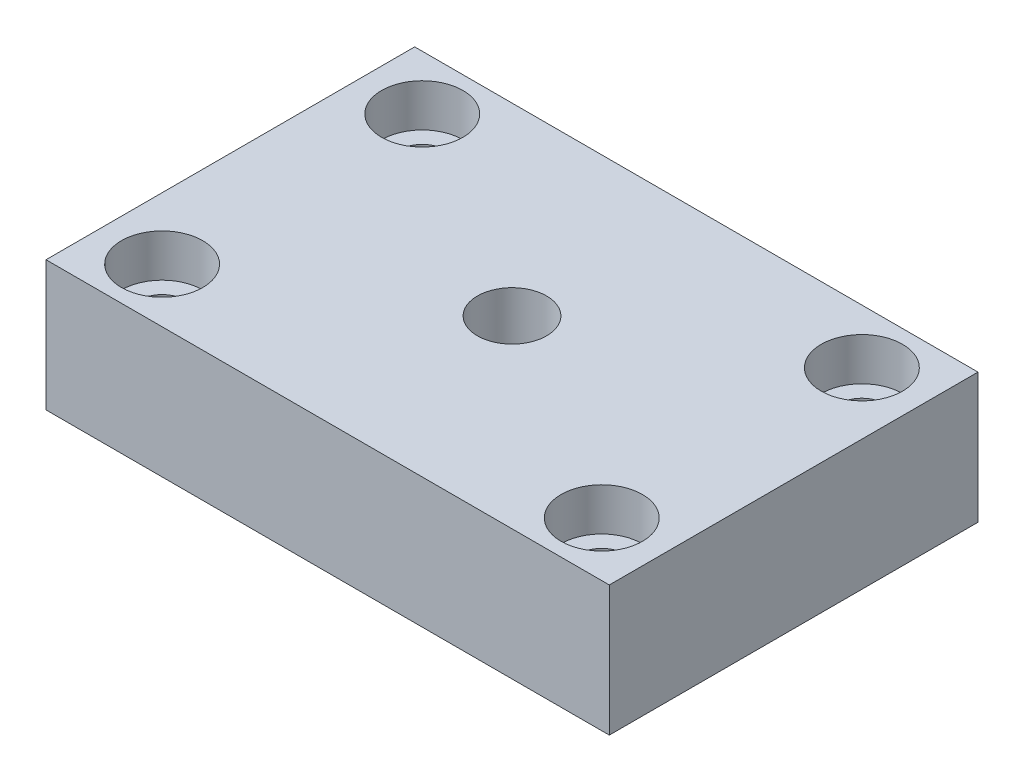
ISO-10303-21;
HEADER;
FILE_DESCRIPTION(('STEP AP214'),'2;1');
FILE_NAME('part.step','',(''),(''),'','','');
FILE_SCHEMA(('AUTOMOTIVE_DESIGN { 1 0 10303 214 1 1 1 1 }'));
ENDSEC;
DATA;
#1=APPLICATION_CONTEXT('core data for automotive mechanical design processes');
#2=APPLICATION_PROTOCOL_DEFINITION('international standard','automotive_design',2000,#1);
#3=PRODUCT_CONTEXT('',#1,'mechanical');
#4=PRODUCT('Part','Part','',(#3));
#5=PRODUCT_RELATED_PRODUCT_CATEGORY('part','',(#4));
#6=PRODUCT_DEFINITION_FORMATION('','',#4);
#7=PRODUCT_DEFINITION_CONTEXT('part definition',#1,'design');
#8=PRODUCT_DEFINITION('design','',#6,#7);
#9=PRODUCT_DEFINITION_SHAPE('','',#8);
#10=(LENGTH_UNIT() NAMED_UNIT(*) SI_UNIT(.MILLI.,.METRE.));
#11=(NAMED_UNIT(*) PLANE_ANGLE_UNIT() SI_UNIT($,.RADIAN.));
#12=(NAMED_UNIT(*) SI_UNIT($,.STERADIAN.) SOLID_ANGLE_UNIT());
#13=UNCERTAINTY_MEASURE_WITH_UNIT(LENGTH_MEASURE(1.E-05),#10,'distance_accuracy_value','');
#14=(GEOMETRIC_REPRESENTATION_CONTEXT(3) GLOBAL_UNCERTAINTY_ASSIGNED_CONTEXT((#13)) GLOBAL_UNIT_ASSIGNED_CONTEXT((#10,
#11,#12)) REPRESENTATION_CONTEXT('',''));
#15=CARTESIAN_POINT('',(0.,0.,0.));
#16=DIRECTION('',(0.,0.,1.));
#17=DIRECTION('',(1.,0.,0.));
#18=AXIS2_PLACEMENT_3D('',#15,#16,#17);
#19=CARTESIAN_POINT('',(27.5,12.7,18.));
#20=DIRECTION('',(-1.,0.,0.));
#21=DIRECTION('',(0.,0.,1.));
#22=AXIS2_PLACEMENT_3D('',#19,#20,#21);
#23=PLANE('',#22);
#24=DIRECTION('',(0.,0.,-1.));
#25=VECTOR('',#24,1.);
#26=CARTESIAN_POINT('',(27.5,0.,18.));
#27=LINE('',#26,#25);
#28=CARTESIAN_POINT('',(27.5,0.,18.));
#29=VERTEX_POINT('',#28);
#30=CARTESIAN_POINT('',(27.5,0.,-18.));
#31=VERTEX_POINT('',#30);
#32=EDGE_CURVE('E99',#29,#31,#27,.T.);
#33=ORIENTED_EDGE('',*,*,#32,.T.);
#34=DIRECTION('',(0.,-1.,0.));
#35=VECTOR('',#34,1.);
#36=CARTESIAN_POINT('',(27.5,12.7,-18.));
#37=LINE('',#36,#35);
#38=CARTESIAN_POINT('',(27.5,12.7,-18.));
#39=VERTEX_POINT('',#38);
#40=EDGE_CURVE('E11',#39,#31,#37,.T.);
#41=ORIENTED_EDGE('',*,*,#40,.F.);
#42=DIRECTION('',(0.,0.,-1.));
#43=VECTOR('',#42,1.);
#44=CARTESIAN_POINT('',(27.5,12.7,18.));
#45=LINE('',#44,#43);
#46=CARTESIAN_POINT('',(27.5,12.7,18.));
#47=VERTEX_POINT('',#46);
#48=EDGE_CURVE('E87',#47,#39,#45,.T.);
#49=ORIENTED_EDGE('',*,*,#48,.F.);
#50=DIRECTION('',(0.,-1.,0.));
#51=VECTOR('',#50,1.);
#52=CARTESIAN_POINT('',(27.5,12.7,18.));
#53=LINE('',#52,#51);
#54=EDGE_CURVE('E95',#47,#29,#53,.T.);
#55=ORIENTED_EDGE('',*,*,#54,.T.);
#56=EDGE_LOOP('',(#33,#41,#49,#55));
#57=FACE_BOUND('',#56,.T.);
#58=ADVANCED_FACE('F36',(#57),#23,.F.);
#59=CARTESIAN_POINT('',(-27.5,12.7,-18.));
#60=DIRECTION('',(0.,0.,1.));
#61=DIRECTION('',(1.,0.,0.));
#62=AXIS2_PLACEMENT_3D('',#59,#60,#61);
#63=PLANE('',#62);
#64=DIRECTION('',(-1.,0.,0.));
#65=VECTOR('',#64,1.);
#66=CARTESIAN_POINT('',(-27.5,0.,-18.));
#67=LINE('',#66,#65);
#68=CARTESIAN_POINT('',(-27.5,0.,-18.));
#69=VERTEX_POINT('',#68);
#70=EDGE_CURVE('E91',#31,#69,#67,.T.);
#71=ORIENTED_EDGE('',*,*,#70,.T.);
#72=DIRECTION('',(0.,-1.,0.));
#73=VECTOR('',#72,1.);
#74=CARTESIAN_POINT('',(-27.5,12.7,-18.));
#75=LINE('',#74,#73);
#76=CARTESIAN_POINT('',(-27.5,12.7,-18.));
#77=VERTEX_POINT('',#76);
#78=EDGE_CURVE('E44',#77,#69,#75,.T.);
#79=ORIENTED_EDGE('',*,*,#78,.F.);
#80=DIRECTION('',(-1.,0.,0.));
#81=VECTOR('',#80,1.);
#82=CARTESIAN_POINT('',(-27.5,12.7,-18.));
#83=LINE('',#82,#81);
#84=EDGE_CURVE('E82',#39,#77,#83,.T.);
#85=ORIENTED_EDGE('',*,*,#84,.F.);
#86=ORIENTED_EDGE('',*,*,#40,.T.);
#87=EDGE_LOOP('',(#71,#79,#85,#86));
#88=FACE_BOUND('',#87,.T.);
#89=ADVANCED_FACE('F90',(#88),#63,.F.);
#90=CARTESIAN_POINT('',(-27.5,12.7,18.));
#91=DIRECTION('',(1.,0.,0.));
#92=DIRECTION('',(0.,0.,-1.));
#93=AXIS2_PLACEMENT_3D('',#90,#91,#92);
#94=PLANE('',#93);
#95=DIRECTION('',(0.,0.,1.));
#96=VECTOR('',#95,1.);
#97=CARTESIAN_POINT('',(-27.5,0.,18.));
#98=LINE('',#97,#96);
#99=CARTESIAN_POINT('',(-27.5,0.,18.));
#100=VERTEX_POINT('',#99);
#101=EDGE_CURVE('E69',#69,#100,#98,.T.);
#102=ORIENTED_EDGE('',*,*,#101,.T.);
#103=DIRECTION('',(0.,-1.,0.));
#104=VECTOR('',#103,1.);
#105=CARTESIAN_POINT('',(-27.5,12.7,18.));
#106=LINE('',#105,#104);
#107=CARTESIAN_POINT('',(-27.5,12.7,18.));
#108=VERTEX_POINT('',#107);
#109=EDGE_CURVE('E92',#108,#100,#106,.T.);
#110=ORIENTED_EDGE('',*,*,#109,.F.);
#111=DIRECTION('',(0.,0.,1.));
#112=VECTOR('',#111,1.);
#113=CARTESIAN_POINT('',(-27.5,12.7,18.));
#114=LINE('',#113,#112);
#115=EDGE_CURVE('E85',#77,#108,#114,.T.);
#116=ORIENTED_EDGE('',*,*,#115,.F.);
#117=ORIENTED_EDGE('',*,*,#78,.T.);
#118=EDGE_LOOP('',(#102,#110,#116,#117));
#119=FACE_BOUND('',#118,.T.);
#120=ADVANCED_FACE('F93',(#119),#94,.F.);
#121=CARTESIAN_POINT('',(-27.5,12.7,18.));
#122=DIRECTION('',(0.,0.,-1.));
#123=DIRECTION('',(-1.,0.,0.));
#124=AXIS2_PLACEMENT_3D('',#121,#122,#123);
#125=PLANE('',#124);
#126=DIRECTION('',(1.,0.,0.));
#127=VECTOR('',#126,1.);
#128=CARTESIAN_POINT('',(-27.5,0.,18.));
#129=LINE('',#128,#127);
#130=EDGE_CURVE('E75',#100,#29,#129,.T.);
#131=ORIENTED_EDGE('',*,*,#130,.T.);
#132=ORIENTED_EDGE('',*,*,#54,.F.);
#133=DIRECTION('',(1.,0.,0.));
#134=VECTOR('',#133,1.);
#135=CARTESIAN_POINT('',(-27.5,12.7,18.));
#136=LINE('',#135,#134);
#137=EDGE_CURVE('E52',#108,#47,#136,.T.);
#138=ORIENTED_EDGE('',*,*,#137,.F.);
#139=ORIENTED_EDGE('',*,*,#109,.T.);
#140=EDGE_LOOP('',(#131,#132,#138,#139));
#141=FACE_BOUND('',#140,.T.);
#142=ADVANCED_FACE('F107',(#141),#125,.F.);
#143=CARTESIAN_POINT('',(0.,12.7,0.));
#144=DIRECTION('',(0.,-1.,0.));
#145=DIRECTION('',(0.,0.,-1.));
#146=AXIS2_PLACEMENT_3D('',#143,#144,#145);
#147=PLANE('',#146);
#148=CARTESIAN_POINT('',(0.,12.7,0.));
#149=DIRECTION('',(0.,-1.,0.));
#150=DIRECTION('',(0.,0.,-1.));
#151=AXIS2_PLACEMENT_3D('',#148,#149,#150);
#152=CIRCLE('',#151,3.3782);
#153=CARTESIAN_POINT('',(0.,12.7,-3.3782));
#154=VERTEX_POINT('',#153);
#155=EDGE_CURVE('E160',#154,#154,#152,.T.);
#156=ORIENTED_EDGE('',*,*,#155,.T.);
#157=EDGE_LOOP('',(#156));
#158=FACE_BOUND('',#157,.T.);
#159=CARTESIAN_POINT('',(-21.463,12.7,-12.7));
#160=DIRECTION('',(0.,1.,0.));
#161=DIRECTION('',(0.,0.,1.));
#162=AXIS2_PLACEMENT_3D('',#159,#160,#161);
#163=CIRCLE('',#162,3.96875);
#164=CARTESIAN_POINT('',(-21.463,12.7,-8.73125));
#165=VERTEX_POINT('',#164);
#166=EDGE_CURVE('E157',#165,#165,#163,.T.);
#167=ORIENTED_EDGE('',*,*,#166,.F.);
#168=EDGE_LOOP('',(#167));
#169=FACE_BOUND('',#168,.T.);
#170=CARTESIAN_POINT('',(-21.463,12.7,12.7));
#171=DIRECTION('',(0.,1.,0.));
#172=DIRECTION('',(0.,0.,1.));
#173=AXIS2_PLACEMENT_3D('',#170,#171,#172);
#174=CIRCLE('',#173,3.96875);
#175=CARTESIAN_POINT('',(-21.463,12.7,16.66875));
#176=VERTEX_POINT('',#175);
#177=EDGE_CURVE('E145',#176,#176,#174,.T.);
#178=ORIENTED_EDGE('',*,*,#177,.F.);
#179=EDGE_LOOP('',(#178));
#180=FACE_BOUND('',#179,.T.);
#181=CARTESIAN_POINT('',(21.463,12.7,12.7));
#182=DIRECTION('',(0.,1.,0.));
#183=DIRECTION('',(0.,0.,1.));
#184=AXIS2_PLACEMENT_3D('',#181,#182,#183);
#185=CIRCLE('',#184,3.96875);
#186=CARTESIAN_POINT('',(21.463,12.7,16.66875));
#187=VERTEX_POINT('',#186);
#188=EDGE_CURVE('E133',#187,#187,#185,.T.);
#189=ORIENTED_EDGE('',*,*,#188,.F.);
#190=EDGE_LOOP('',(#189));
#191=FACE_BOUND('',#190,.T.);
#192=CARTESIAN_POINT('',(21.463,12.7,-12.7));
#193=DIRECTION('',(0.,1.,0.));
#194=DIRECTION('',(0.,0.,1.));
#195=AXIS2_PLACEMENT_3D('',#192,#193,#194);
#196=CIRCLE('',#195,3.96875);
#197=CARTESIAN_POINT('',(21.463,12.7,-8.73125));
#198=VERTEX_POINT('',#197);
#199=EDGE_CURVE('E121',#198,#198,#196,.T.);
#200=ORIENTED_EDGE('',*,*,#199,.F.);
#201=EDGE_LOOP('',(#200));
#202=FACE_BOUND('',#201,.T.);
#203=ORIENTED_EDGE('',*,*,#48,.T.);
#204=ORIENTED_EDGE('',*,*,#84,.T.);
#205=ORIENTED_EDGE('',*,*,#115,.T.);
#206=ORIENTED_EDGE('',*,*,#137,.T.);
#207=EDGE_LOOP('',(#203,#204,#205,#206));
#208=FACE_BOUND('',#207,.T.);
#209=ADVANCED_FACE('F83',(#158,#169,#180,#191,#202,#208),#147,.F.);
#210=CARTESIAN_POINT('',(0.,0.,0.));
#211=DIRECTION('',(0.,-1.,0.));
#212=DIRECTION('',(0.,0.,-1.));
#213=AXIS2_PLACEMENT_3D('',#210,#211,#212);
#214=PLANE('',#213);
#215=CARTESIAN_POINT('',(0.,0.,0.));
#216=DIRECTION('',(0.,-1.,0.));
#217=DIRECTION('',(0.,0.,-1.));
#218=AXIS2_PLACEMENT_3D('',#215,#216,#217);
#219=CIRCLE('',#218,5.55625);
#220=CARTESIAN_POINT('',(0.,0.,-5.55625));
#221=VERTEX_POINT('',#220);
#222=EDGE_CURVE('E169',#221,#221,#219,.T.);
#223=ORIENTED_EDGE('',*,*,#222,.F.);
#224=EDGE_LOOP('',(#223));
#225=FACE_BOUND('',#224,.T.);
#226=CARTESIAN_POINT('',(-21.463,0.,-12.7));
#227=DIRECTION('',(0.,1.,0.));
#228=DIRECTION('',(0.,0.,1.));
#229=AXIS2_PLACEMENT_3D('',#226,#227,#228);
#230=CIRCLE('',#229,2.2479);
#231=CARTESIAN_POINT('',(-21.463,0.,-10.4521));
#232=VERTEX_POINT('',#231);
#233=EDGE_CURVE('E148',#232,#232,#230,.T.);
#234=ORIENTED_EDGE('',*,*,#233,.T.);
#235=EDGE_LOOP('',(#234));
#236=FACE_BOUND('',#235,.T.);
#237=CARTESIAN_POINT('',(-21.463,0.,12.7));
#238=DIRECTION('',(0.,1.,0.));
#239=DIRECTION('',(0.,0.,1.));
#240=AXIS2_PLACEMENT_3D('',#237,#238,#239);
#241=CIRCLE('',#240,2.2479);
#242=CARTESIAN_POINT('',(-21.463,0.,14.9479));
#243=VERTEX_POINT('',#242);
#244=EDGE_CURVE('E136',#243,#243,#241,.T.);
#245=ORIENTED_EDGE('',*,*,#244,.T.);
#246=EDGE_LOOP('',(#245));
#247=FACE_BOUND('',#246,.T.);
#248=CARTESIAN_POINT('',(21.463,0.,12.7));
#249=DIRECTION('',(0.,1.,0.));
#250=DIRECTION('',(0.,0.,1.));
#251=AXIS2_PLACEMENT_3D('',#248,#249,#250);
#252=CIRCLE('',#251,2.2479);
#253=CARTESIAN_POINT('',(21.463,0.,14.9479));
#254=VERTEX_POINT('',#253);
#255=EDGE_CURVE('E124',#254,#254,#252,.T.);
#256=ORIENTED_EDGE('',*,*,#255,.T.);
#257=EDGE_LOOP('',(#256));
#258=FACE_BOUND('',#257,.T.);
#259=CARTESIAN_POINT('',(21.463,0.,-12.7));
#260=DIRECTION('',(0.,1.,0.));
#261=DIRECTION('',(0.,0.,1.));
#262=AXIS2_PLACEMENT_3D('',#259,#260,#261);
#263=CIRCLE('',#262,2.2479);
#264=CARTESIAN_POINT('',(21.463,0.,-10.4521));
#265=VERTEX_POINT('',#264);
#266=EDGE_CURVE('E102',#265,#265,#263,.T.);
#267=ORIENTED_EDGE('',*,*,#266,.T.);
#268=EDGE_LOOP('',(#267));
#269=FACE_BOUND('',#268,.T.);
#270=ORIENTED_EDGE('',*,*,#32,.F.);
#271=ORIENTED_EDGE('',*,*,#130,.F.);
#272=ORIENTED_EDGE('',*,*,#101,.F.);
#273=ORIENTED_EDGE('',*,*,#70,.F.);
#274=EDGE_LOOP('',(#270,#271,#272,#273));
#275=FACE_BOUND('',#274,.T.);
#276=ADVANCED_FACE('F110',(#225,#236,#247,#258,#269,#275),#214,.T.);
#277=CARTESIAN_POINT('',(21.463,12.7,-12.7));
#278=DIRECTION('',(0.,1.,0.));
#279=DIRECTION('',(0.,0.,1.));
#280=AXIS2_PLACEMENT_3D('',#277,#278,#279);
#281=CYLINDRICAL_SURFACE('',#280,2.2479);
#282=ORIENTED_EDGE('',*,*,#266,.F.);
#283=EDGE_LOOP('',(#282));
#284=FACE_BOUND('',#283,.T.);
#285=CARTESIAN_POINT('',(21.463,8.5344,-12.7));
#286=DIRECTION('',(0.,1.,0.));
#287=DIRECTION('',(0.,0.,1.));
#288=AXIS2_PLACEMENT_3D('',#285,#286,#287);
#289=CIRCLE('',#288,2.2479);
#290=CARTESIAN_POINT('',(21.463,8.5344,-10.4521));
#291=VERTEX_POINT('',#290);
#292=EDGE_CURVE('E115',#291,#291,#289,.T.);
#293=ORIENTED_EDGE('',*,*,#292,.T.);
#294=EDGE_LOOP('',(#293));
#295=FACE_BOUND('',#294,.T.);
#296=ADVANCED_FACE('F177',(#284,#295),#281,.F.);
#297=CARTESIAN_POINT('',(23.7109,8.5344,-12.7));
#298=DIRECTION('',(0.,-1.,0.));
#299=DIRECTION('',(0.,0.,-1.));
#300=AXIS2_PLACEMENT_3D('',#297,#298,#299);
#301=PLANE('',#300);
#302=ORIENTED_EDGE('',*,*,#292,.F.);
#303=EDGE_LOOP('',(#302));
#304=FACE_BOUND('',#303,.T.);
#305=CARTESIAN_POINT('',(21.463,8.5344,-12.7));
#306=DIRECTION('',(0.,1.,0.));
#307=DIRECTION('',(0.,0.,1.));
#308=AXIS2_PLACEMENT_3D('',#305,#306,#307);
#309=CIRCLE('',#308,3.96875);
#310=CARTESIAN_POINT('',(21.463,8.5344,-8.73125));
#311=VERTEX_POINT('',#310);
#312=EDGE_CURVE('E118',#311,#311,#309,.T.);
#313=ORIENTED_EDGE('',*,*,#312,.T.);
#314=EDGE_LOOP('',(#313));
#315=FACE_BOUND('',#314,.T.);
#316=ADVANCED_FACE('F189',(#304,#315),#301,.F.);
#317=CARTESIAN_POINT('',(21.463,12.7,-12.7));
#318=DIRECTION('',(0.,1.,0.));
#319=DIRECTION('',(0.,0.,1.));
#320=AXIS2_PLACEMENT_3D('',#317,#318,#319);
#321=CYLINDRICAL_SURFACE('',#320,3.96875);
#322=ORIENTED_EDGE('',*,*,#312,.F.);
#323=EDGE_LOOP('',(#322));
#324=FACE_BOUND('',#323,.T.);
#325=ORIENTED_EDGE('',*,*,#199,.T.);
#326=EDGE_LOOP('',(#325));
#327=FACE_BOUND('',#326,.T.);
#328=ADVANCED_FACE('F195',(#324,#327),#321,.F.);
#329=CARTESIAN_POINT('',(21.463,12.7,12.7));
#330=DIRECTION('',(0.,1.,0.));
#331=DIRECTION('',(0.,0.,1.));
#332=AXIS2_PLACEMENT_3D('',#329,#330,#331);
#333=CYLINDRICAL_SURFACE('',#332,2.2479);
#334=ORIENTED_EDGE('',*,*,#255,.F.);
#335=EDGE_LOOP('',(#334));
#336=FACE_BOUND('',#335,.T.);
#337=CARTESIAN_POINT('',(21.463,8.5344,12.7));
#338=DIRECTION('',(0.,1.,0.));
#339=DIRECTION('',(0.,0.,1.));
#340=AXIS2_PLACEMENT_3D('',#337,#338,#339);
#341=CIRCLE('',#340,2.2479);
#342=CARTESIAN_POINT('',(21.463,8.5344,14.9479));
#343=VERTEX_POINT('',#342);
#344=EDGE_CURVE('E127',#343,#343,#341,.T.);
#345=ORIENTED_EDGE('',*,*,#344,.T.);
#346=EDGE_LOOP('',(#345));
#347=FACE_BOUND('',#346,.T.);
#348=ADVANCED_FACE('F201',(#336,#347),#333,.F.);
#349=CARTESIAN_POINT('',(23.7109,8.5344,12.7));
#350=DIRECTION('',(0.,-1.,0.));
#351=DIRECTION('',(0.,0.,-1.));
#352=AXIS2_PLACEMENT_3D('',#349,#350,#351);
#353=PLANE('',#352);
#354=ORIENTED_EDGE('',*,*,#344,.F.);
#355=EDGE_LOOP('',(#354));
#356=FACE_BOUND('',#355,.T.);
#357=CARTESIAN_POINT('',(21.463,8.5344,12.7));
#358=DIRECTION('',(0.,1.,0.));
#359=DIRECTION('',(0.,0.,1.));
#360=AXIS2_PLACEMENT_3D('',#357,#358,#359);
#361=CIRCLE('',#360,3.96875);
#362=CARTESIAN_POINT('',(21.463,8.5344,16.66875));
#363=VERTEX_POINT('',#362);
#364=EDGE_CURVE('E130',#363,#363,#361,.T.);
#365=ORIENTED_EDGE('',*,*,#364,.T.);
#366=EDGE_LOOP('',(#365));
#367=FACE_BOUND('',#366,.T.);
#368=ADVANCED_FACE('F256',(#356,#367),#353,.F.);
#369=CARTESIAN_POINT('',(21.463,12.7,12.7));
#370=DIRECTION('',(0.,1.,0.));
#371=DIRECTION('',(0.,0.,1.));
#372=AXIS2_PLACEMENT_3D('',#369,#370,#371);
#373=CYLINDRICAL_SURFACE('',#372,3.96875);
#374=ORIENTED_EDGE('',*,*,#364,.F.);
#375=EDGE_LOOP('',(#374));
#376=FACE_BOUND('',#375,.T.);
#377=ORIENTED_EDGE('',*,*,#188,.T.);
#378=EDGE_LOOP('',(#377));
#379=FACE_BOUND('',#378,.T.);
#380=ADVANCED_FACE('F266',(#376,#379),#373,.F.);
#381=CARTESIAN_POINT('',(-21.463,12.7,12.7));
#382=DIRECTION('',(0.,1.,0.));
#383=DIRECTION('',(0.,0.,1.));
#384=AXIS2_PLACEMENT_3D('',#381,#382,#383);
#385=CYLINDRICAL_SURFACE('',#384,2.2479);
#386=ORIENTED_EDGE('',*,*,#244,.F.);
#387=EDGE_LOOP('',(#386));
#388=FACE_BOUND('',#387,.T.);
#389=CARTESIAN_POINT('',(-21.463,8.5344,12.7));
#390=DIRECTION('',(0.,1.,0.));
#391=DIRECTION('',(0.,0.,1.));
#392=AXIS2_PLACEMENT_3D('',#389,#390,#391);
#393=CIRCLE('',#392,2.2479);
#394=CARTESIAN_POINT('',(-21.463,8.5344,14.9479));
#395=VERTEX_POINT('',#394);
#396=EDGE_CURVE('E139',#395,#395,#393,.T.);
#397=ORIENTED_EDGE('',*,*,#396,.T.);
#398=EDGE_LOOP('',(#397));
#399=FACE_BOUND('',#398,.T.);
#400=ADVANCED_FACE('F276',(#388,#399),#385,.F.);
#401=CARTESIAN_POINT('',(-19.2151,8.5344,12.7));
#402=DIRECTION('',(0.,-1.,0.));
#403=DIRECTION('',(0.,0.,-1.));
#404=AXIS2_PLACEMENT_3D('',#401,#402,#403);
#405=PLANE('',#404);
#406=ORIENTED_EDGE('',*,*,#396,.F.);
#407=EDGE_LOOP('',(#406));
#408=FACE_BOUND('',#407,.T.);
#409=CARTESIAN_POINT('',(-21.463,8.5344,12.7));
#410=DIRECTION('',(0.,1.,0.));
#411=DIRECTION('',(0.,0.,1.));
#412=AXIS2_PLACEMENT_3D('',#409,#410,#411);
#413=CIRCLE('',#412,3.96875);
#414=CARTESIAN_POINT('',(-21.463,8.5344,16.66875));
#415=VERTEX_POINT('',#414);
#416=EDGE_CURVE('E142',#415,#415,#413,.T.);
#417=ORIENTED_EDGE('',*,*,#416,.T.);
#418=EDGE_LOOP('',(#417));
#419=FACE_BOUND('',#418,.T.);
#420=ADVANCED_FACE('F286',(#408,#419),#405,.F.);
#421=CARTESIAN_POINT('',(-21.463,12.7,12.7));
#422=DIRECTION('',(0.,1.,0.));
#423=DIRECTION('',(0.,0.,1.));
#424=AXIS2_PLACEMENT_3D('',#421,#422,#423);
#425=CYLINDRICAL_SURFACE('',#424,3.96875);
#426=ORIENTED_EDGE('',*,*,#416,.F.);
#427=EDGE_LOOP('',(#426));
#428=FACE_BOUND('',#427,.T.);
#429=ORIENTED_EDGE('',*,*,#177,.T.);
#430=EDGE_LOOP('',(#429));
#431=FACE_BOUND('',#430,.T.);
#432=ADVANCED_FACE('F296',(#428,#431),#425,.F.);
#433=CARTESIAN_POINT('',(-21.463,12.7,-12.7));
#434=DIRECTION('',(0.,1.,0.));
#435=DIRECTION('',(0.,0.,1.));
#436=AXIS2_PLACEMENT_3D('',#433,#434,#435);
#437=CYLINDRICAL_SURFACE('',#436,2.2479);
#438=ORIENTED_EDGE('',*,*,#233,.F.);
#439=EDGE_LOOP('',(#438));
#440=FACE_BOUND('',#439,.T.);
#441=CARTESIAN_POINT('',(-21.463,8.5344,-12.7));
#442=DIRECTION('',(0.,1.,0.));
#443=DIRECTION('',(0.,0.,1.));
#444=AXIS2_PLACEMENT_3D('',#441,#442,#443);
#445=CIRCLE('',#444,2.2479);
#446=CARTESIAN_POINT('',(-21.463,8.5344,-10.4521));
#447=VERTEX_POINT('',#446);
#448=EDGE_CURVE('E151',#447,#447,#445,.T.);
#449=ORIENTED_EDGE('',*,*,#448,.T.);
#450=EDGE_LOOP('',(#449));
#451=FACE_BOUND('',#450,.T.);
#452=ADVANCED_FACE('F306',(#440,#451),#437,.F.);
#453=CARTESIAN_POINT('',(-19.2151,8.5344,-12.7));
#454=DIRECTION('',(0.,-1.,0.));
#455=DIRECTION('',(0.,0.,-1.));
#456=AXIS2_PLACEMENT_3D('',#453,#454,#455);
#457=PLANE('',#456);
#458=ORIENTED_EDGE('',*,*,#448,.F.);
#459=EDGE_LOOP('',(#458));
#460=FACE_BOUND('',#459,.T.);
#461=CARTESIAN_POINT('',(-21.463,8.5344,-12.7));
#462=DIRECTION('',(0.,1.,0.));
#463=DIRECTION('',(0.,0.,1.));
#464=AXIS2_PLACEMENT_3D('',#461,#462,#463);
#465=CIRCLE('',#464,3.96875);
#466=CARTESIAN_POINT('',(-21.463,8.5344,-8.73125));
#467=VERTEX_POINT('',#466);
#468=EDGE_CURVE('E154',#467,#467,#465,.T.);
#469=ORIENTED_EDGE('',*,*,#468,.T.);
#470=EDGE_LOOP('',(#469));
#471=FACE_BOUND('',#470,.T.);
#472=ADVANCED_FACE('F316',(#460,#471),#457,.F.);
#473=CARTESIAN_POINT('',(-21.463,12.7,-12.7));
#474=DIRECTION('',(0.,1.,0.));
#475=DIRECTION('',(0.,0.,1.));
#476=AXIS2_PLACEMENT_3D('',#473,#474,#475);
#477=CYLINDRICAL_SURFACE('',#476,3.96875);
#478=ORIENTED_EDGE('',*,*,#468,.F.);
#479=EDGE_LOOP('',(#478));
#480=FACE_BOUND('',#479,.T.);
#481=ORIENTED_EDGE('',*,*,#166,.T.);
#482=EDGE_LOOP('',(#481));
#483=FACE_BOUND('',#482,.T.);
#484=ADVANCED_FACE('F326',(#480,#483),#477,.F.);
#485=CARTESIAN_POINT('',(0.,0.,0.));
#486=DIRECTION('',(0.,-1.,0.));
#487=DIRECTION('',(0.,0.,-1.));
#488=AXIS2_PLACEMENT_3D('',#485,#486,#487);
#489=CYLINDRICAL_SURFACE('',#488,3.3782);
#490=ORIENTED_EDGE('',*,*,#155,.F.);
#491=EDGE_LOOP('',(#490));
#492=FACE_BOUND('',#491,.T.);
#493=CARTESIAN_POINT('',(0.,6.35,0.));
#494=DIRECTION('',(0.,-1.,0.));
#495=DIRECTION('',(0.,0.,-1.));
#496=AXIS2_PLACEMENT_3D('',#493,#494,#495);
#497=CIRCLE('',#496,3.3782);
#498=CARTESIAN_POINT('',(0.,6.35,-3.3782));
#499=VERTEX_POINT('',#498);
#500=EDGE_CURVE('E163',#499,#499,#497,.T.);
#501=ORIENTED_EDGE('',*,*,#500,.T.);
#502=EDGE_LOOP('',(#501));
#503=FACE_BOUND('',#502,.T.);
#504=ADVANCED_FACE('F335',(#492,#503),#489,.F.);
#505=CARTESIAN_POINT('',(3.3782,6.35,0.));
#506=DIRECTION('',(0.,1.,0.));
#507=DIRECTION('',(0.,0.,1.));
#508=AXIS2_PLACEMENT_3D('',#505,#506,#507);
#509=PLANE('',#508);
#510=ORIENTED_EDGE('',*,*,#500,.F.);
#511=EDGE_LOOP('',(#510));
#512=FACE_BOUND('',#511,.T.);
#513=CARTESIAN_POINT('',(0.,6.35,0.));
#514=DIRECTION('',(0.,-1.,0.));
#515=DIRECTION('',(0.,0.,-1.));
#516=AXIS2_PLACEMENT_3D('',#513,#514,#515);
#517=CIRCLE('',#516,5.55625);
#518=CARTESIAN_POINT('',(0.,6.35,-5.55625));
#519=VERTEX_POINT('',#518);
#520=EDGE_CURVE('E166',#519,#519,#517,.T.);
#521=ORIENTED_EDGE('',*,*,#520,.T.);
#522=EDGE_LOOP('',(#521));
#523=FACE_BOUND('',#522,.T.);
#524=ADVANCED_FACE('F354',(#512,#523),#509,.F.);
#525=CARTESIAN_POINT('',(0.,0.,0.));
#526=DIRECTION('',(0.,-1.,0.));
#527=DIRECTION('',(0.,0.,-1.));
#528=AXIS2_PLACEMENT_3D('',#525,#526,#527);
#529=CYLINDRICAL_SURFACE('',#528,5.55625);
#530=ORIENTED_EDGE('',*,*,#520,.F.);
#531=EDGE_LOOP('',(#530));
#532=FACE_BOUND('',#531,.T.);
#533=ORIENTED_EDGE('',*,*,#222,.T.);
#534=EDGE_LOOP('',(#533));
#535=FACE_BOUND('',#534,.T.);
#536=ADVANCED_FACE('F173',(#532,#535),#529,.F.);
#537=CLOSED_SHELL('',(#58,#89,#120,#142,#209,#276,#296,#316,#328,#348,#368,#380,#400,#420,#432,
#452,#472,#484,#504,#524,#536));
#538=MANIFOLD_SOLID_BREP('B2',#537);
#539=ADVANCED_BREP_SHAPE_REPRESENTATION('',(#18,#538),#14);
#540=SHAPE_DEFINITION_REPRESENTATION(#9,#539);
ENDSEC;
END-ISO-10303-21;
